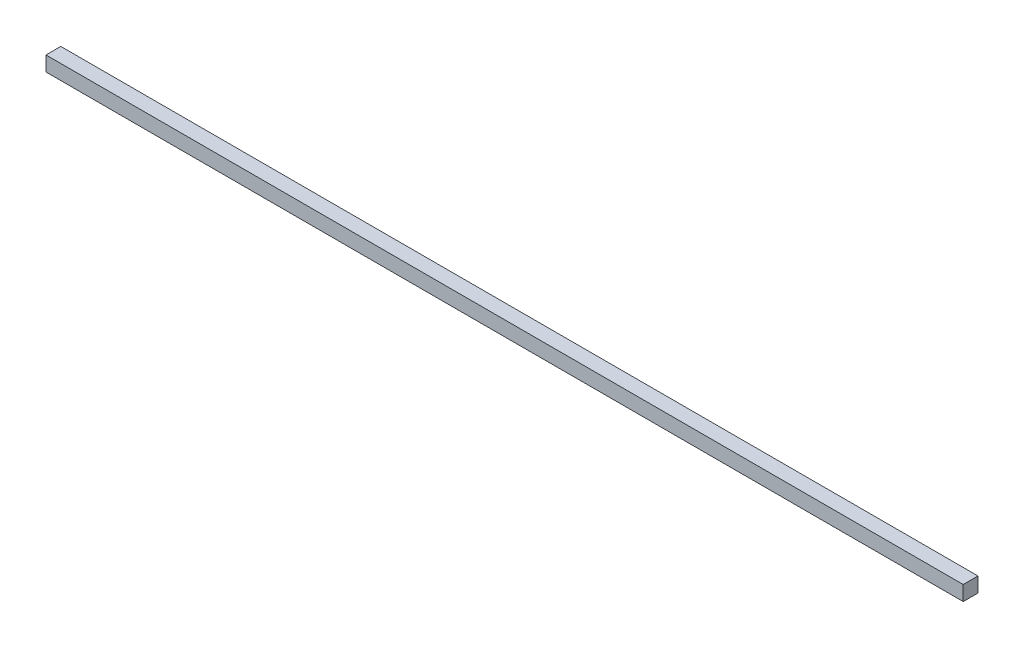
ISO-10303-21;
HEADER;
FILE_DESCRIPTION(('STEP AP214'),'2;1');
FILE_NAME('part.step','',(''),(''),'','','');
FILE_SCHEMA(('AUTOMOTIVE_DESIGN { 1 0 10303 214 1 1 1 1 }'));
ENDSEC;
DATA;
#1=APPLICATION_CONTEXT('core data for automotive mechanical design processes');
#2=APPLICATION_PROTOCOL_DEFINITION('international standard','automotive_design',2000,#1);
#3=PRODUCT_CONTEXT('',#1,'mechanical');
#4=PRODUCT('Part','Part','',(#3));
#5=PRODUCT_RELATED_PRODUCT_CATEGORY('part','',(#4));
#6=PRODUCT_DEFINITION_FORMATION('','',#4);
#7=PRODUCT_DEFINITION_CONTEXT('part definition',#1,'design');
#8=PRODUCT_DEFINITION('design','',#6,#7);
#9=PRODUCT_DEFINITION_SHAPE('','',#8);
#10=(LENGTH_UNIT() NAMED_UNIT(*) SI_UNIT(.MILLI.,.METRE.));
#11=(NAMED_UNIT(*) PLANE_ANGLE_UNIT() SI_UNIT($,.RADIAN.));
#12=(NAMED_UNIT(*) SI_UNIT($,.STERADIAN.) SOLID_ANGLE_UNIT());
#13=UNCERTAINTY_MEASURE_WITH_UNIT(LENGTH_MEASURE(1.E-05),#10,'distance_accuracy_value','');
#14=(GEOMETRIC_REPRESENTATION_CONTEXT(3) GLOBAL_UNCERTAINTY_ASSIGNED_CONTEXT((#13)) GLOBAL_UNIT_ASSIGNED_CONTEXT((#10,
#11,#12)) REPRESENTATION_CONTEXT('',''));
#15=CARTESIAN_POINT('',(0.,0.,0.));
#16=DIRECTION('',(0.,0.,1.));
#17=DIRECTION('',(1.,0.,0.));
#18=AXIS2_PLACEMENT_3D('',#15,#16,#17);
#19=CARTESIAN_POINT('',(-72.2995759050271,3.,-81.0914671849803));
#20=DIRECTION('',(1.,0.,0.));
#21=DIRECTION('',(0.,0.,-1.));
#22=AXIS2_PLACEMENT_3D('',#19,#20,#21);
#23=PLANE('',#22);
#24=DIRECTION('',(0.,0.,1.));
#25=VECTOR('',#24,1.);
#26=CARTESIAN_POINT('',(-72.2995759050271,0.,-81.0914671849803));
#27=LINE('',#26,#25);
#28=CARTESIAN_POINT('',(-72.2995759050271,0.,-84.0914671849803));
#29=VERTEX_POINT('',#28);
#30=CARTESIAN_POINT('',(-72.2995759050271,0.,-81.0914671849803));
#31=VERTEX_POINT('',#30);
#32=EDGE_CURVE('E95',#29,#31,#27,.T.);
#33=ORIENTED_EDGE('',*,*,#32,.T.);
#34=DIRECTION('',(0.,-1.,0.));
#35=VECTOR('',#34,1.);
#36=CARTESIAN_POINT('',(-72.2995759050271,3.,-81.0914671849803));
#37=LINE('',#36,#35);
#38=CARTESIAN_POINT('',(-72.2995759050271,3.,-81.0914671849803));
#39=VERTEX_POINT('',#38);
#40=EDGE_CURVE('E11',#39,#31,#37,.T.);
#41=ORIENTED_EDGE('',*,*,#40,.F.);
#42=DIRECTION('',(0.,0.,1.));
#43=VECTOR('',#42,1.);
#44=CARTESIAN_POINT('',(-72.2995759050271,3.,-81.0914671849803));
#45=LINE('',#44,#43);
#46=CARTESIAN_POINT('',(-72.2995759050271,3.,-84.0914671849803));
#47=VERTEX_POINT('',#46);
#48=EDGE_CURVE('E83',#47,#39,#45,.T.);
#49=ORIENTED_EDGE('',*,*,#48,.F.);
#50=DIRECTION('',(0.,-1.,0.));
#51=VECTOR('',#50,1.);
#52=CARTESIAN_POINT('',(-72.2995759050271,3.,-84.0914671849803));
#53=LINE('',#52,#51);
#54=EDGE_CURVE('E91',#47,#29,#53,.T.);
#55=ORIENTED_EDGE('',*,*,#54,.T.);
#56=EDGE_LOOP('',(#33,#41,#49,#55));
#57=FACE_BOUND('',#56,.T.);
#58=ADVANCED_FACE('F32',(#57),#23,.F.);
#59=CARTESIAN_POINT('',(-72.2995759050271,3.,-81.0914671849803));
#60=DIRECTION('',(0.,0.,-1.));
#61=DIRECTION('',(-1.,0.,0.));
#62=AXIS2_PLACEMENT_3D('',#59,#60,#61);
#63=PLANE('',#62);
#64=DIRECTION('',(1.,0.,0.));
#65=VECTOR('',#64,1.);
#66=CARTESIAN_POINT('',(-72.2995759050271,0.,-81.0914671849803));
#67=LINE('',#66,#65);
#68=CARTESIAN_POINT('',(113.700424094973,0.,-81.0914671849803));
#69=VERTEX_POINT('',#68);
#70=EDGE_CURVE('E87',#31,#69,#67,.T.);
#71=ORIENTED_EDGE('',*,*,#70,.T.);
#72=DIRECTION('',(0.,-1.,0.));
#73=VECTOR('',#72,1.);
#74=CARTESIAN_POINT('',(113.700424094973,3.,-81.0914671849803));
#75=LINE('',#74,#73);
#76=CARTESIAN_POINT('',(113.700424094973,3.,-81.0914671849803));
#77=VERTEX_POINT('',#76);
#78=EDGE_CURVE('E40',#77,#69,#75,.T.);
#79=ORIENTED_EDGE('',*,*,#78,.F.);
#80=DIRECTION('',(1.,0.,0.));
#81=VECTOR('',#80,1.);
#82=CARTESIAN_POINT('',(-72.2995759050271,3.,-81.0914671849803));
#83=LINE('',#82,#81);
#84=EDGE_CURVE('E78',#39,#77,#83,.T.);
#85=ORIENTED_EDGE('',*,*,#84,.F.);
#86=ORIENTED_EDGE('',*,*,#40,.T.);
#87=EDGE_LOOP('',(#71,#79,#85,#86));
#88=FACE_BOUND('',#87,.T.);
#89=ADVANCED_FACE('F86',(#88),#63,.F.);
#90=CARTESIAN_POINT('',(113.700424094973,3.,-81.0914671849803));
#91=DIRECTION('',(-1.,0.,0.));
#92=DIRECTION('',(0.,0.,1.));
#93=AXIS2_PLACEMENT_3D('',#90,#91,#92);
#94=PLANE('',#93);
#95=DIRECTION('',(0.,0.,-1.));
#96=VECTOR('',#95,1.);
#97=CARTESIAN_POINT('',(113.700424094973,0.,-81.0914671849803));
#98=LINE('',#97,#96);
#99=CARTESIAN_POINT('',(113.700424094973,0.,-84.0914671849803));
#100=VERTEX_POINT('',#99);
#101=EDGE_CURVE('E65',#69,#100,#98,.T.);
#102=ORIENTED_EDGE('',*,*,#101,.T.);
#103=DIRECTION('',(0.,-1.,0.));
#104=VECTOR('',#103,1.);
#105=CARTESIAN_POINT('',(113.700424094973,3.,-84.0914671849803));
#106=LINE('',#105,#104);
#107=CARTESIAN_POINT('',(113.700424094973,3.,-84.0914671849803));
#108=VERTEX_POINT('',#107);
#109=EDGE_CURVE('E88',#108,#100,#106,.T.);
#110=ORIENTED_EDGE('',*,*,#109,.F.);
#111=DIRECTION('',(0.,0.,-1.));
#112=VECTOR('',#111,1.);
#113=CARTESIAN_POINT('',(113.700424094973,3.,-81.0914671849803));
#114=LINE('',#113,#112);
#115=EDGE_CURVE('E81',#77,#108,#114,.T.);
#116=ORIENTED_EDGE('',*,*,#115,.F.);
#117=ORIENTED_EDGE('',*,*,#78,.T.);
#118=EDGE_LOOP('',(#102,#110,#116,#117));
#119=FACE_BOUND('',#118,.T.);
#120=ADVANCED_FACE('F89',(#119),#94,.F.);
#121=CARTESIAN_POINT('',(-72.2995759050271,3.,-84.0914671849803));
#122=DIRECTION('',(0.,0.,1.));
#123=DIRECTION('',(1.,0.,0.));
#124=AXIS2_PLACEMENT_3D('',#121,#122,#123);
#125=PLANE('',#124);
#126=DIRECTION('',(-1.,0.,0.));
#127=VECTOR('',#126,1.);
#128=CARTESIAN_POINT('',(-72.2995759050271,0.,-84.0914671849803));
#129=LINE('',#128,#127);
#130=EDGE_CURVE('E71',#100,#29,#129,.T.);
#131=ORIENTED_EDGE('',*,*,#130,.T.);
#132=ORIENTED_EDGE('',*,*,#54,.F.);
#133=DIRECTION('',(-1.,0.,0.));
#134=VECTOR('',#133,1.);
#135=CARTESIAN_POINT('',(-72.2995759050271,3.,-84.0914671849803));
#136=LINE('',#135,#134);
#137=EDGE_CURVE('E48',#108,#47,#136,.T.);
#138=ORIENTED_EDGE('',*,*,#137,.F.);
#139=ORIENTED_EDGE('',*,*,#109,.T.);
#140=EDGE_LOOP('',(#131,#132,#138,#139));
#141=FACE_BOUND('',#140,.T.);
#142=ADVANCED_FACE('F102',(#141),#125,.F.);
#143=CARTESIAN_POINT('',(0.,3.,0.));
#144=DIRECTION('',(0.,-1.,0.));
#145=DIRECTION('',(0.,0.,-1.));
#146=AXIS2_PLACEMENT_3D('',#143,#144,#145);
#147=PLANE('',#146);
#148=ORIENTED_EDGE('',*,*,#48,.T.);
#149=ORIENTED_EDGE('',*,*,#84,.T.);
#150=ORIENTED_EDGE('',*,*,#115,.T.);
#151=ORIENTED_EDGE('',*,*,#137,.T.);
#152=EDGE_LOOP('',(#148,#149,#150,#151));
#153=FACE_BOUND('',#152,.T.);
#154=ADVANCED_FACE('F79',(#153),#147,.F.);
#155=CARTESIAN_POINT('',(0.,0.,0.));
#156=DIRECTION('',(0.,-1.,0.));
#157=DIRECTION('',(0.,0.,-1.));
#158=AXIS2_PLACEMENT_3D('',#155,#156,#157);
#159=PLANE('',#158);
#160=ORIENTED_EDGE('',*,*,#32,.F.);
#161=ORIENTED_EDGE('',*,*,#130,.F.);
#162=ORIENTED_EDGE('',*,*,#101,.F.);
#163=ORIENTED_EDGE('',*,*,#70,.F.);
#164=EDGE_LOOP('',(#160,#161,#162,#163));
#165=FACE_BOUND('',#164,.T.);
#166=ADVANCED_FACE('F105',(#165),#159,.T.);
#167=CLOSED_SHELL('',(#58,#89,#120,#142,#154,#166));
#168=MANIFOLD_SOLID_BREP('B2',#167);
#169=ADVANCED_BREP_SHAPE_REPRESENTATION('',(#18,#168),#14);
#170=SHAPE_DEFINITION_REPRESENTATION(#9,#169);
ENDSEC;
END-ISO-10303-21;
